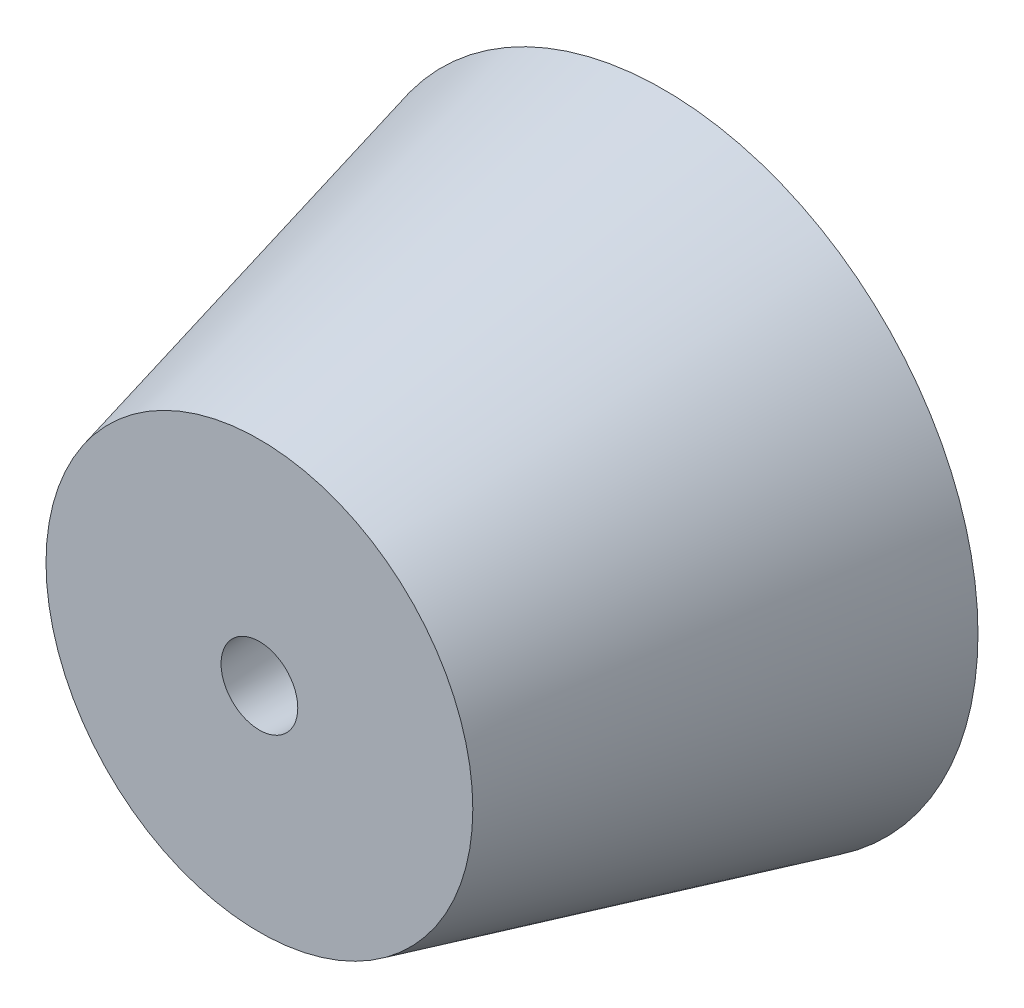
ISO-10303-21;
HEADER;
FILE_DESCRIPTION(('STEP AP214'),'2;1');
FILE_NAME('part.step','',(''),(''),'','','');
FILE_SCHEMA(('AUTOMOTIVE_DESIGN { 1 0 10303 214 1 1 1 1 }'));
ENDSEC;
DATA;
#1=APPLICATION_CONTEXT('core data for automotive mechanical design processes');
#2=APPLICATION_PROTOCOL_DEFINITION('international standard','automotive_design',2000,#1);
#3=PRODUCT_CONTEXT('',#1,'mechanical');
#4=PRODUCT('Part','Part','',(#3));
#5=PRODUCT_RELATED_PRODUCT_CATEGORY('part','',(#4));
#6=PRODUCT_DEFINITION_FORMATION('','',#4);
#7=PRODUCT_DEFINITION_CONTEXT('part definition',#1,'design');
#8=PRODUCT_DEFINITION('design','',#6,#7);
#9=PRODUCT_DEFINITION_SHAPE('','',#8);
#10=(LENGTH_UNIT() NAMED_UNIT(*) SI_UNIT(.MILLI.,.METRE.));
#11=(NAMED_UNIT(*) PLANE_ANGLE_UNIT() SI_UNIT($,.RADIAN.));
#12=(NAMED_UNIT(*) SI_UNIT($,.STERADIAN.) SOLID_ANGLE_UNIT());
#13=UNCERTAINTY_MEASURE_WITH_UNIT(LENGTH_MEASURE(1.E-05),#10,'distance_accuracy_value','');
#14=(GEOMETRIC_REPRESENTATION_CONTEXT(3) GLOBAL_UNCERTAINTY_ASSIGNED_CONTEXT((#13)) GLOBAL_UNIT_ASSIGNED_CONTEXT((#10,
#11,#12)) REPRESENTATION_CONTEXT('',''));
#15=CARTESIAN_POINT('',(0.,0.,0.));
#16=DIRECTION('',(0.,0.,1.));
#17=DIRECTION('',(1.,0.,0.));
#18=AXIS2_PLACEMENT_3D('',#15,#16,#17);
#19=CARTESIAN_POINT('',(0.,74.8004712149666,0.));
#20=DIRECTION('',(0.,0.,-1.));
#21=DIRECTION('',(1.,0.,0.));
#22=AXIS2_PLACEMENT_3D('',#19,#20,#21);
#23=CONICAL_SURFACE('',#22,7.7709990893729,0.244346095279206);
#24=CARTESIAN_POINT('',(0.,74.8004712149666,10.));
#25=DIRECTION('',(0.,0.,1.));
#26=DIRECTION('',(1.,0.,0.));
#27=AXIS2_PLACEMENT_3D('',#24,#25,#26);
#28=CIRCLE('',#27,5.27771906094109);
#29=CARTESIAN_POINT('',(5.27771906094109,74.8004712149666,10.));
#30=VERTEX_POINT('',#29);
#31=EDGE_CURVE('E10',#30,#30,#28,.T.);
#32=ORIENTED_EDGE('',*,*,#31,.F.);
#33=EDGE_LOOP('',(#32));
#34=FACE_BOUND('',#33,.T.);
#35=CARTESIAN_POINT('',(0.,74.8004712149666,0.));
#36=DIRECTION('',(0.,0.,1.));
#37=DIRECTION('',(1.,0.,0.));
#38=AXIS2_PLACEMENT_3D('',#35,#36,#37);
#39=CIRCLE('',#38,7.7709990893729);
#40=CARTESIAN_POINT('',(7.7709990893729,74.8004712149666,0.));
#41=VERTEX_POINT('',#40);
#42=EDGE_CURVE('E45',#41,#41,#39,.T.);
#43=ORIENTED_EDGE('',*,*,#42,.T.);
#44=EDGE_LOOP('',(#43));
#45=FACE_BOUND('',#44,.T.);
#46=ADVANCED_FACE('F39',(#34,#45),#23,.T.);
#47=CARTESIAN_POINT('',(0.,74.8004712149666,10.));
#48=DIRECTION('',(0.,0.,1.));
#49=DIRECTION('',(1.,0.,0.));
#50=AXIS2_PLACEMENT_3D('',#47,#48,#49);
#51=PLANE('',#50);
#52=CARTESIAN_POINT('',(0.,74.8004712149666,10.));
#53=DIRECTION('',(0.,0.,1.));
#54=DIRECTION('',(1.,0.,0.));
#55=AXIS2_PLACEMENT_3D('',#52,#53,#54);
#56=CIRCLE('',#55,0.948912265979806);
#57=CARTESIAN_POINT('',(0.948912265979806,74.8004712149666,10.));
#58=VERTEX_POINT('',#57);
#59=EDGE_CURVE('E49',#58,#58,#56,.T.);
#60=ORIENTED_EDGE('',*,*,#59,.F.);
#61=EDGE_LOOP('',(#60));
#62=FACE_BOUND('',#61,.T.);
#63=ORIENTED_EDGE('',*,*,#31,.T.);
#64=EDGE_LOOP('',(#63));
#65=FACE_BOUND('',#64,.T.);
#66=ADVANCED_FACE('F64',(#62,#65),#51,.T.);
#67=CARTESIAN_POINT('',(0.,74.8004712149666,0.));
#68=DIRECTION('',(0.,0.,1.));
#69=DIRECTION('',(1.,0.,0.));
#70=AXIS2_PLACEMENT_3D('',#67,#68,#69);
#71=PLANE('',#70);
#72=CARTESIAN_POINT('',(0.,74.8004712149666,0.));
#73=DIRECTION('',(0.,0.,-1.));
#74=DIRECTION('',(-1.,0.,0.));
#75=AXIS2_PLACEMENT_3D('',#72,#73,#74);
#76=CIRCLE('',#75,1.47299005881022);
#77=CARTESIAN_POINT('',(-1.47299005881022,74.8004712149666,0.));
#78=VERTEX_POINT('',#77);
#79=EDGE_CURVE('E53',#78,#78,#76,.T.);
#80=ORIENTED_EDGE('',*,*,#79,.F.);
#81=EDGE_LOOP('',(#80));
#82=FACE_BOUND('',#81,.T.);
#83=ORIENTED_EDGE('',*,*,#42,.F.);
#84=EDGE_LOOP('',(#83));
#85=FACE_BOUND('',#84,.T.);
#86=ADVANCED_FACE('F61',(#82,#85),#71,.F.);
#87=CARTESIAN_POINT('',(0.,74.8004712149666,0.));
#88=DIRECTION('',(0.,0.,-1.));
#89=DIRECTION('',(-1.,0.,0.));
#90=AXIS2_PLACEMENT_3D('',#87,#88,#89);
#91=CONICAL_SURFACE('',#90,1.47299005881022,0.0523598775598299);
#92=ORIENTED_EDGE('',*,*,#59,.T.);
#93=EDGE_LOOP('',(#92));
#94=FACE_BOUND('',#93,.T.);
#95=ORIENTED_EDGE('',*,*,#79,.T.);
#96=EDGE_LOOP('',(#95));
#97=FACE_BOUND('',#96,.T.);
#98=ADVANCED_FACE('F59',(#94,#97),#91,.F.);
#99=CLOSED_SHELL('',(#46,#66,#86,#98));
#100=MANIFOLD_SOLID_BREP('B2',#99);
#101=ADVANCED_BREP_SHAPE_REPRESENTATION('',(#18,#100),#14);
#102=SHAPE_DEFINITION_REPRESENTATION(#9,#101);
ENDSEC;
END-ISO-10303-21;
